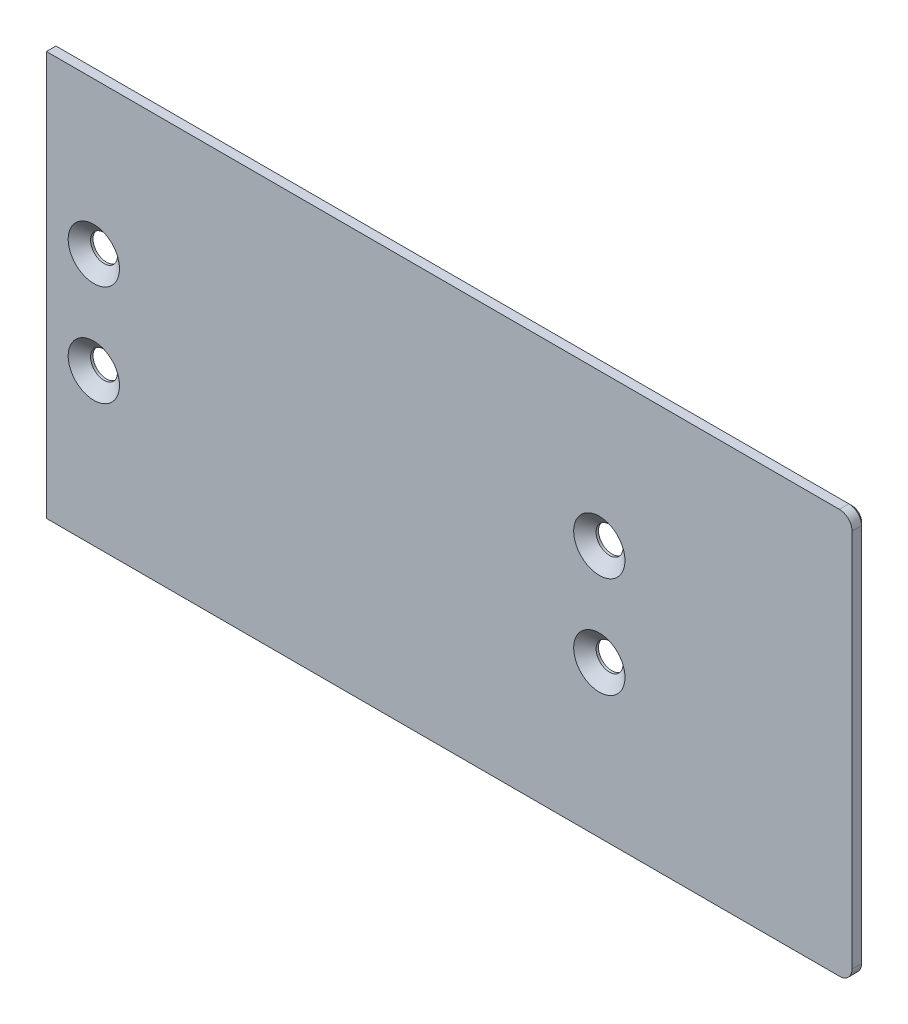
ISO-10303-21;
HEADER;
FILE_DESCRIPTION(('STEP AP214'),'2;1');
FILE_NAME('part.step','',(''),(''),'','','');
FILE_SCHEMA(('AUTOMOTIVE_DESIGN { 1 0 10303 214 1 1 1 1 }'));
ENDSEC;
DATA;
#1=APPLICATION_CONTEXT('core data for automotive mechanical design processes');
#2=APPLICATION_PROTOCOL_DEFINITION('international standard','automotive_design',2000,#1);
#3=PRODUCT_CONTEXT('',#1,'mechanical');
#4=PRODUCT('Part','Part','',(#3));
#5=PRODUCT_RELATED_PRODUCT_CATEGORY('part','',(#4));
#6=PRODUCT_DEFINITION_FORMATION('','',#4);
#7=PRODUCT_DEFINITION_CONTEXT('part definition',#1,'design');
#8=PRODUCT_DEFINITION('design','',#6,#7);
#9=PRODUCT_DEFINITION_SHAPE('','',#8);
#10=(LENGTH_UNIT() NAMED_UNIT(*) SI_UNIT(.MILLI.,.METRE.));
#11=(NAMED_UNIT(*) PLANE_ANGLE_UNIT() SI_UNIT($,.RADIAN.));
#12=(NAMED_UNIT(*) SI_UNIT($,.STERADIAN.) SOLID_ANGLE_UNIT());
#13=UNCERTAINTY_MEASURE_WITH_UNIT(LENGTH_MEASURE(1.E-05),#10,'distance_accuracy_value','');
#14=(GEOMETRIC_REPRESENTATION_CONTEXT(3) GLOBAL_UNCERTAINTY_ASSIGNED_CONTEXT((#13)) GLOBAL_UNIT_ASSIGNED_CONTEXT((#10,
#11,#12)) REPRESENTATION_CONTEXT('',''));
#15=CARTESIAN_POINT('',(0.,0.,0.));
#16=DIRECTION('',(0.,0.,1.));
#17=DIRECTION('',(1.,0.,0.));
#18=AXIS2_PLACEMENT_3D('',#15,#16,#17);
#19=CARTESIAN_POINT('',(202.40625,-101.6,0.));
#20=DIRECTION('',(1.,0.,0.));
#21=DIRECTION('',(0.,0.,-1.));
#22=AXIS2_PLACEMENT_3D('',#19,#20,#21);
#23=PLANE('',#22);
#24=DIRECTION('',(0.,0.,1.));
#25=VECTOR('',#24,1.);
#26=CARTESIAN_POINT('',(202.40625,-98.425,0.));
#27=LINE('',#26,#25);
#28=CARTESIAN_POINT('',(202.40625,-98.425,0.787400000000022));
#29=VERTEX_POINT('',#28);
#30=CARTESIAN_POINT('',(202.40625,-98.425,3.175));
#31=VERTEX_POINT('',#30);
#32=EDGE_CURVE('E128',#29,#31,#27,.T.);
#33=ORIENTED_EDGE('',*,*,#32,.F.);
#34=DIRECTION('',(0.,1.,0.));
#35=VECTOR('',#34,1.);
#36=CARTESIAN_POINT('',(202.40625,-101.6,0.787399999999994));
#37=LINE('',#36,#35);
#38=CARTESIAN_POINT('',(202.40625,-3.175,0.787400000000022));
#39=VERTEX_POINT('',#38);
#40=EDGE_CURVE('E142',#29,#39,#37,.T.);
#41=ORIENTED_EDGE('',*,*,#40,.T.);
#42=DIRECTION('',(0.,0.,1.));
#43=VECTOR('',#42,1.);
#44=CARTESIAN_POINT('',(202.40625,-3.175,0.));
#45=LINE('',#44,#43);
#46=CARTESIAN_POINT('',(202.40625,-3.175,3.175));
#47=VERTEX_POINT('',#46);
#48=EDGE_CURVE('E117',#39,#47,#45,.T.);
#49=ORIENTED_EDGE('',*,*,#48,.T.);
#50=DIRECTION('',(0.,1.,0.));
#51=VECTOR('',#50,1.);
#52=CARTESIAN_POINT('',(202.40625,-101.6,3.175));
#53=LINE('',#52,#51);
#54=EDGE_CURVE('E127',#31,#47,#53,.T.);
#55=ORIENTED_EDGE('',*,*,#54,.F.);
#56=EDGE_LOOP('',(#33,#41,#49,#55));
#57=FACE_BOUND('',#56,.T.);
#58=ADVANCED_FACE('F36',(#57),#23,.T.);
#59=CARTESIAN_POINT('',(0.,-101.6,0.));
#60=DIRECTION('',(0.,1.,0.));
#61=DIRECTION('',(0.,0.,1.));
#62=AXIS2_PLACEMENT_3D('',#59,#60,#61);
#63=PLANE('',#62);
#64=DIRECTION('',(0.,0.,1.));
#65=VECTOR('',#64,1.);
#66=CARTESIAN_POINT('',(0.,-101.6,0.));
#67=LINE('',#66,#65);
#68=CARTESIAN_POINT('',(0.,-101.6,0.787400000000021));
#69=VERTEX_POINT('',#68);
#70=CARTESIAN_POINT('',(0.,-101.6,3.175));
#71=VERTEX_POINT('',#70);
#72=EDGE_CURVE('E133',#69,#71,#67,.T.);
#73=ORIENTED_EDGE('',*,*,#72,.F.);
#74=DIRECTION('',(1.,0.,0.));
#75=VECTOR('',#74,1.);
#76=CARTESIAN_POINT('',(199.23125,-101.6,0.787400000000021));
#77=LINE('',#76,#75);
#78=CARTESIAN_POINT('',(199.23125,-101.6,0.787400000000021));
#79=VERTEX_POINT('',#78);
#80=EDGE_CURVE('E11',#69,#79,#77,.T.);
#81=ORIENTED_EDGE('',*,*,#80,.T.);
#82=DIRECTION('',(0.,0.,1.));
#83=VECTOR('',#82,1.);
#84=CARTESIAN_POINT('',(199.23125,-101.6,0.));
#85=LINE('',#84,#83);
#86=CARTESIAN_POINT('',(199.23125,-101.6,3.175));
#87=VERTEX_POINT('',#86);
#88=EDGE_CURVE('E186',#79,#87,#85,.T.);
#89=ORIENTED_EDGE('',*,*,#88,.T.);
#90=DIRECTION('',(1.,0.,0.));
#91=VECTOR('',#90,1.);
#92=CARTESIAN_POINT('',(0.,-101.6,3.175));
#93=LINE('',#92,#91);
#94=EDGE_CURVE('E135',#71,#87,#93,.T.);
#95=ORIENTED_EDGE('',*,*,#94,.F.);
#96=EDGE_LOOP('',(#73,#81,#89,#95));
#97=FACE_BOUND('',#96,.T.);
#98=ADVANCED_FACE('F231',(#97),#63,.F.);
#99=CARTESIAN_POINT('',(0.,0.,0.));
#100=DIRECTION('',(0.,1.,0.));
#101=DIRECTION('',(0.,0.,1.));
#102=AXIS2_PLACEMENT_3D('',#99,#100,#101);
#103=PLANE('',#102);
#104=DIRECTION('',(0.,0.,1.));
#105=VECTOR('',#104,1.);
#106=CARTESIAN_POINT('',(199.23125,0.,0.));
#107=LINE('',#106,#105);
#108=CARTESIAN_POINT('',(199.23125,0.,0.787400000000021));
#109=VERTEX_POINT('',#108);
#110=CARTESIAN_POINT('',(199.23125,0.,3.175));
#111=VERTEX_POINT('',#110);
#112=EDGE_CURVE('E108',#109,#111,#107,.T.);
#113=ORIENTED_EDGE('',*,*,#112,.F.);
#114=DIRECTION('',(-1.,0.,0.));
#115=VECTOR('',#114,1.);
#116=CARTESIAN_POINT('',(0.,0.,0.787400000000021));
#117=LINE('',#116,#115);
#118=CARTESIAN_POINT('',(0.,0.,0.787400000000021));
#119=VERTEX_POINT('',#118);
#120=EDGE_CURVE('E61',#109,#119,#117,.T.);
#121=ORIENTED_EDGE('',*,*,#120,.T.);
#122=DIRECTION('',(0.,0.,1.));
#123=VECTOR('',#122,1.);
#124=CARTESIAN_POINT('',(0.,0.,0.));
#125=LINE('',#124,#123);
#126=CARTESIAN_POINT('',(0.,0.,3.175));
#127=VERTEX_POINT('',#126);
#128=EDGE_CURVE('E131',#119,#127,#125,.T.);
#129=ORIENTED_EDGE('',*,*,#128,.T.);
#130=DIRECTION('',(1.,0.,0.));
#131=VECTOR('',#130,1.);
#132=CARTESIAN_POINT('',(0.,0.,3.175));
#133=LINE('',#132,#131);
#134=EDGE_CURVE('E124',#127,#111,#133,.T.);
#135=ORIENTED_EDGE('',*,*,#134,.T.);
#136=EDGE_LOOP('',(#113,#121,#129,#135));
#137=FACE_BOUND('',#136,.T.);
#138=ADVANCED_FACE('F130',(#137),#103,.T.);
#139=CARTESIAN_POINT('',(0.,-101.6,0.));
#140=DIRECTION('',(-1.,0.,0.));
#141=DIRECTION('',(0.,0.,1.));
#142=AXIS2_PLACEMENT_3D('',#139,#140,#141);
#143=PLANE('',#142);
#144=ORIENTED_EDGE('',*,*,#128,.F.);
#145=DIRECTION('',(0.,-1.,0.));
#146=VECTOR('',#145,1.);
#147=CARTESIAN_POINT('',(0.,-101.6,0.787400000000021));
#148=LINE('',#147,#146);
#149=EDGE_CURVE('E46',#119,#69,#148,.T.);
#150=ORIENTED_EDGE('',*,*,#149,.T.);
#151=ORIENTED_EDGE('',*,*,#72,.T.);
#152=DIRECTION('',(0.,1.,0.));
#153=VECTOR('',#152,1.);
#154=CARTESIAN_POINT('',(0.,-101.6,3.175));
#155=LINE('',#154,#153);
#156=EDGE_CURVE('E143',#71,#127,#155,.T.);
#157=ORIENTED_EDGE('',*,*,#156,.T.);
#158=EDGE_LOOP('',(#144,#150,#151,#157));
#159=FACE_BOUND('',#158,.T.);
#160=ADVANCED_FACE('F260',(#159),#143,.T.);
#161=CARTESIAN_POINT('',(0.,-101.6,0.));
#162=DIRECTION('',(0.,0.,-1.));
#163=DIRECTION('',(-1.,0.,0.));
#164=AXIS2_PLACEMENT_3D('',#161,#162,#163);
#165=PLANE('',#164);
#166=CARTESIAN_POINT('',(199.23125,-3.17499999999999,0.));
#167=DIRECTION('',(0.,0.,-1.));
#168=DIRECTION('',(-1.,0.,0.));
#169=AXIS2_PLACEMENT_3D('',#166,#167,#168);
#170=CIRCLE('',#169,2.38759999999996);
#171=CARTESIAN_POINT('',(199.23125,-0.787400000000021,0.));
#172=VERTEX_POINT('',#171);
#173=CARTESIAN_POINT('',(201.61885,-3.175,0.));
#174=VERTEX_POINT('',#173);
#175=EDGE_CURVE('E155',#172,#174,#170,.T.);
#176=ORIENTED_EDGE('',*,*,#175,.T.);
#177=DIRECTION('',(0.,-1.,0.));
#178=VECTOR('',#177,1.);
#179=CARTESIAN_POINT('',(201.61885,-101.6,0.));
#180=LINE('',#179,#178);
#181=CARTESIAN_POINT('',(201.61885,-98.425,0.));
#182=VERTEX_POINT('',#181);
#183=EDGE_CURVE('E157',#174,#182,#180,.T.);
#184=ORIENTED_EDGE('',*,*,#183,.T.);
#185=CARTESIAN_POINT('',(199.23125,-98.425,0.));
#186=DIRECTION('',(0.,0.,-1.));
#187=DIRECTION('',(-1.,0.,0.));
#188=AXIS2_PLACEMENT_3D('',#185,#186,#187);
#189=CIRCLE('',#188,2.38759999999998);
#190=CARTESIAN_POINT('',(199.23125,-100.8126,0.));
#191=VERTEX_POINT('',#190);
#192=EDGE_CURVE('E153',#182,#191,#189,.T.);
#193=ORIENTED_EDGE('',*,*,#192,.T.);
#194=DIRECTION('',(-1.,0.,0.));
#195=VECTOR('',#194,1.);
#196=CARTESIAN_POINT('',(0.,-100.8126,0.));
#197=LINE('',#196,#195);
#198=CARTESIAN_POINT('',(0.787400000000021,-100.8126,0.));
#199=VERTEX_POINT('',#198);
#200=EDGE_CURVE('E147',#191,#199,#197,.T.);
#201=ORIENTED_EDGE('',*,*,#200,.T.);
#202=DIRECTION('',(0.,1.,0.));
#203=VECTOR('',#202,1.);
#204=CARTESIAN_POINT('',(0.787400000000021,-101.6,0.));
#205=LINE('',#204,#203);
#206=CARTESIAN_POINT('',(0.787400000000021,-0.787400000000021,0.));
#207=VERTEX_POINT('',#206);
#208=EDGE_CURVE('E149',#199,#207,#205,.T.);
#209=ORIENTED_EDGE('',*,*,#208,.T.);
#210=DIRECTION('',(1.,0.,0.));
#211=VECTOR('',#210,1.);
#212=CARTESIAN_POINT('',(0.,-0.787400000000021,0.));
#213=LINE('',#212,#211);
#214=EDGE_CURVE('E151',#207,#172,#213,.T.);
#215=ORIENTED_EDGE('',*,*,#214,.T.);
#216=EDGE_LOOP('',(#176,#184,#193,#201,#209,#215));
#217=FACE_BOUND('',#216,.T.);
#218=CARTESIAN_POINT('',(11.90625,-38.1,0.));
#219=DIRECTION('',(0.,0.,1.));
#220=DIRECTION('',(1.,0.,0.));
#221=AXIS2_PLACEMENT_3D('',#218,#219,#220);
#222=CIRCLE('',#221,3.3782);
#223=CARTESIAN_POINT('',(15.28445,-38.1,0.));
#224=VERTEX_POINT('',#223);
#225=EDGE_CURVE('E201',#224,#224,#222,.T.);
#226=ORIENTED_EDGE('',*,*,#225,.T.);
#227=EDGE_LOOP('',(#226));
#228=FACE_BOUND('',#227,.T.);
#229=CARTESIAN_POINT('',(11.90625,-63.5,0.));
#230=DIRECTION('',(0.,0.,1.));
#231=DIRECTION('',(1.,0.,0.));
#232=AXIS2_PLACEMENT_3D('',#229,#230,#231);
#233=CIRCLE('',#232,3.3782);
#234=CARTESIAN_POINT('',(15.28445,-63.5,0.));
#235=VERTEX_POINT('',#234);
#236=EDGE_CURVE('E210',#235,#235,#233,.T.);
#237=ORIENTED_EDGE('',*,*,#236,.T.);
#238=EDGE_LOOP('',(#237));
#239=FACE_BOUND('',#238,.T.);
#240=CARTESIAN_POINT('',(138.90625,-63.5,0.));
#241=DIRECTION('',(0.,0.,1.));
#242=DIRECTION('',(1.,0.,0.));
#243=AXIS2_PLACEMENT_3D('',#240,#241,#242);
#244=CIRCLE('',#243,3.3782);
#245=CARTESIAN_POINT('',(142.28445,-63.5,0.));
#246=VERTEX_POINT('',#245);
#247=EDGE_CURVE('E219',#246,#246,#244,.T.);
#248=ORIENTED_EDGE('',*,*,#247,.T.);
#249=EDGE_LOOP('',(#248));
#250=FACE_BOUND('',#249,.T.);
#251=CARTESIAN_POINT('',(138.90625,-38.1,0.));
#252=DIRECTION('',(0.,0.,1.));
#253=DIRECTION('',(1.,0.,0.));
#254=AXIS2_PLACEMENT_3D('',#251,#252,#253);
#255=CIRCLE('',#254,3.3782);
#256=CARTESIAN_POINT('',(142.28445,-38.1,0.));
#257=VERTEX_POINT('',#256);
#258=EDGE_CURVE('E137',#257,#257,#255,.T.);
#259=ORIENTED_EDGE('',*,*,#258,.T.);
#260=EDGE_LOOP('',(#259));
#261=FACE_BOUND('',#260,.T.);
#262=ADVANCED_FACE('F255',(#217,#228,#239,#250,#261),#165,.T.);
#263=CARTESIAN_POINT('',(0.,-101.6,3.175));
#264=DIRECTION('',(0.,0.,1.));
#265=DIRECTION('',(1.,0.,0.));
#266=AXIS2_PLACEMENT_3D('',#263,#264,#265);
#267=PLANE('',#266);
#268=CARTESIAN_POINT('',(199.23125,-3.17499999999999,3.175));
#269=DIRECTION('',(0.,0.,-1.));
#270=DIRECTION('',(1.,0.,0.));
#271=AXIS2_PLACEMENT_3D('',#268,#269,#270);
#272=CIRCLE('',#271,3.17499999999999);
#273=EDGE_CURVE('E112',#111,#47,#272,.T.);
#274=ORIENTED_EDGE('',*,*,#273,.F.);
#275=ORIENTED_EDGE('',*,*,#134,.F.);
#276=ORIENTED_EDGE('',*,*,#156,.F.);
#277=ORIENTED_EDGE('',*,*,#94,.T.);
#278=CARTESIAN_POINT('',(199.23125,-98.425,3.175));
#279=DIRECTION('',(0.,0.,-1.));
#280=DIRECTION('',(-1.,0.,0.));
#281=AXIS2_PLACEMENT_3D('',#278,#279,#280);
#282=CIRCLE('',#281,3.17499999999999);
#283=EDGE_CURVE('E180',#31,#87,#282,.T.);
#284=ORIENTED_EDGE('',*,*,#283,.F.);
#285=ORIENTED_EDGE('',*,*,#54,.T.);
#286=EDGE_LOOP('',(#274,#275,#276,#277,#284,#285));
#287=FACE_BOUND('',#286,.T.);
#288=CARTESIAN_POINT('',(11.90625,-38.1,3.175));
#289=DIRECTION('',(0.,0.,1.));
#290=DIRECTION('',(1.,0.,0.));
#291=AXIS2_PLACEMENT_3D('',#288,#289,#290);
#292=CIRCLE('',#291,6.4389);
#293=CARTESIAN_POINT('',(18.34515,-38.1,3.175));
#294=VERTEX_POINT('',#293);
#295=EDGE_CURVE('E195',#294,#294,#292,.T.);
#296=ORIENTED_EDGE('',*,*,#295,.F.);
#297=EDGE_LOOP('',(#296));
#298=FACE_BOUND('',#297,.T.);
#299=CARTESIAN_POINT('',(11.90625,-63.5,3.175));
#300=DIRECTION('',(0.,0.,1.));
#301=DIRECTION('',(1.,0.,0.));
#302=AXIS2_PLACEMENT_3D('',#299,#300,#301);
#303=CIRCLE('',#302,6.4389);
#304=CARTESIAN_POINT('',(18.34515,-63.5,3.175));
#305=VERTEX_POINT('',#304);
#306=EDGE_CURVE('E204',#305,#305,#303,.T.);
#307=ORIENTED_EDGE('',*,*,#306,.F.);
#308=EDGE_LOOP('',(#307));
#309=FACE_BOUND('',#308,.T.);
#310=CARTESIAN_POINT('',(138.90625,-63.5,3.175));
#311=DIRECTION('',(0.,0.,1.));
#312=DIRECTION('',(1.,0.,0.));
#313=AXIS2_PLACEMENT_3D('',#310,#311,#312);
#314=CIRCLE('',#313,6.4389);
#315=CARTESIAN_POINT('',(145.34515,-63.5,3.175));
#316=VERTEX_POINT('',#315);
#317=EDGE_CURVE('E213',#316,#316,#314,.T.);
#318=ORIENTED_EDGE('',*,*,#317,.F.);
#319=EDGE_LOOP('',(#318));
#320=FACE_BOUND('',#319,.T.);
#321=CARTESIAN_POINT('',(138.90625,-38.1,3.175));
#322=DIRECTION('',(0.,0.,1.));
#323=DIRECTION('',(1.,0.,0.));
#324=AXIS2_PLACEMENT_3D('',#321,#322,#323);
#325=CIRCLE('',#324,6.4389);
#326=CARTESIAN_POINT('',(145.34515,-38.1,3.175));
#327=VERTEX_POINT('',#326);
#328=EDGE_CURVE('E222',#327,#327,#325,.T.);
#329=ORIENTED_EDGE('',*,*,#328,.F.);
#330=EDGE_LOOP('',(#329));
#331=FACE_BOUND('',#330,.T.);
#332=ADVANCED_FACE('F121',(#287,#298,#309,#320,#331),#267,.T.);
#333=CARTESIAN_POINT('',(138.90625,-38.1,3.175));
#334=DIRECTION('',(0.,0.,1.));
#335=DIRECTION('',(1.,0.,0.));
#336=AXIS2_PLACEMENT_3D('',#333,#334,#335);
#337=CYLINDRICAL_SURFACE('',#336,3.3782);
#338=ORIENTED_EDGE('',*,*,#258,.F.);
#339=EDGE_LOOP('',(#338));
#340=FACE_BOUND('',#339,.T.);
#341=CARTESIAN_POINT('',(138.90625,-38.1,0.6067677588557));
#342=DIRECTION('',(0.,0.,1.));
#343=DIRECTION('',(1.,0.,0.));
#344=AXIS2_PLACEMENT_3D('',#341,#342,#343);
#345=CIRCLE('',#344,3.3782);
#346=CARTESIAN_POINT('',(142.28445,-38.1,0.6067677588557));
#347=VERTEX_POINT('',#346);
#348=EDGE_CURVE('E225',#347,#347,#345,.T.);
#349=ORIENTED_EDGE('',*,*,#348,.T.);
#350=EDGE_LOOP('',(#349));
#351=FACE_BOUND('',#350,.T.);
#352=ADVANCED_FACE('F259',(#340,#351),#337,.F.);
#353=CARTESIAN_POINT('',(138.90625,-38.1,3.175));
#354=DIRECTION('',(0.,0.,1.));
#355=DIRECTION('',(1.,0.,0.));
#356=AXIS2_PLACEMENT_3D('',#353,#354,#355);
#357=CONICAL_SURFACE('',#356,6.4389,0.872664625997165);
#358=ORIENTED_EDGE('',*,*,#348,.F.);
#359=EDGE_LOOP('',(#358));
#360=FACE_BOUND('',#359,.T.);
#361=ORIENTED_EDGE('',*,*,#328,.T.);
#362=EDGE_LOOP('',(#361));
#363=FACE_BOUND('',#362,.T.);
#364=ADVANCED_FACE('F313',(#360,#363),#357,.F.);
#365=CARTESIAN_POINT('',(138.90625,-63.5,3.175));
#366=DIRECTION('',(0.,0.,1.));
#367=DIRECTION('',(1.,0.,0.));
#368=AXIS2_PLACEMENT_3D('',#365,#366,#367);
#369=CYLINDRICAL_SURFACE('',#368,3.3782);
#370=ORIENTED_EDGE('',*,*,#247,.F.);
#371=EDGE_LOOP('',(#370));
#372=FACE_BOUND('',#371,.T.);
#373=CARTESIAN_POINT('',(138.90625,-63.5,0.6067677588557));
#374=DIRECTION('',(0.,0.,1.));
#375=DIRECTION('',(1.,0.,0.));
#376=AXIS2_PLACEMENT_3D('',#373,#374,#375);
#377=CIRCLE('',#376,3.3782);
#378=CARTESIAN_POINT('',(142.28445,-63.5,0.6067677588557));
#379=VERTEX_POINT('',#378);
#380=EDGE_CURVE('E216',#379,#379,#377,.T.);
#381=ORIENTED_EDGE('',*,*,#380,.T.);
#382=EDGE_LOOP('',(#381));
#383=FACE_BOUND('',#382,.T.);
#384=ADVANCED_FACE('F319',(#372,#383),#369,.F.);
#385=CARTESIAN_POINT('',(138.90625,-63.5,3.175));
#386=DIRECTION('',(0.,0.,1.));
#387=DIRECTION('',(1.,0.,0.));
#388=AXIS2_PLACEMENT_3D('',#385,#386,#387);
#389=CONICAL_SURFACE('',#388,6.4389,0.872664625997165);
#390=ORIENTED_EDGE('',*,*,#380,.F.);
#391=EDGE_LOOP('',(#390));
#392=FACE_BOUND('',#391,.T.);
#393=ORIENTED_EDGE('',*,*,#317,.T.);
#394=EDGE_LOOP('',(#393));
#395=FACE_BOUND('',#394,.T.);
#396=ADVANCED_FACE('F326',(#392,#395),#389,.F.);
#397=CARTESIAN_POINT('',(11.90625,-63.5,3.175));
#398=DIRECTION('',(0.,0.,1.));
#399=DIRECTION('',(1.,0.,0.));
#400=AXIS2_PLACEMENT_3D('',#397,#398,#399);
#401=CYLINDRICAL_SURFACE('',#400,3.3782);
#402=ORIENTED_EDGE('',*,*,#236,.F.);
#403=EDGE_LOOP('',(#402));
#404=FACE_BOUND('',#403,.T.);
#405=CARTESIAN_POINT('',(11.90625,-63.5,0.6067677588557));
#406=DIRECTION('',(0.,0.,1.));
#407=DIRECTION('',(1.,0.,0.));
#408=AXIS2_PLACEMENT_3D('',#405,#406,#407);
#409=CIRCLE('',#408,3.3782);
#410=CARTESIAN_POINT('',(15.28445,-63.5,0.6067677588557));
#411=VERTEX_POINT('',#410);
#412=EDGE_CURVE('E207',#411,#411,#409,.T.);
#413=ORIENTED_EDGE('',*,*,#412,.T.);
#414=EDGE_LOOP('',(#413));
#415=FACE_BOUND('',#414,.T.);
#416=ADVANCED_FACE('F372',(#404,#415),#401,.F.);
#417=CARTESIAN_POINT('',(11.90625,-63.5,3.175));
#418=DIRECTION('',(0.,0.,1.));
#419=DIRECTION('',(1.,0.,0.));
#420=AXIS2_PLACEMENT_3D('',#417,#418,#419);
#421=CONICAL_SURFACE('',#420,6.4389,0.872664625997165);
#422=ORIENTED_EDGE('',*,*,#412,.F.);
#423=EDGE_LOOP('',(#422));
#424=FACE_BOUND('',#423,.T.);
#425=ORIENTED_EDGE('',*,*,#306,.T.);
#426=EDGE_LOOP('',(#425));
#427=FACE_BOUND('',#426,.T.);
#428=ADVANCED_FACE('F381',(#424,#427),#421,.F.);
#429=CARTESIAN_POINT('',(11.90625,-38.1,3.175));
#430=DIRECTION('',(0.,0.,1.));
#431=DIRECTION('',(1.,0.,0.));
#432=AXIS2_PLACEMENT_3D('',#429,#430,#431);
#433=CYLINDRICAL_SURFACE('',#432,3.3782);
#434=ORIENTED_EDGE('',*,*,#225,.F.);
#435=EDGE_LOOP('',(#434));
#436=FACE_BOUND('',#435,.T.);
#437=CARTESIAN_POINT('',(11.90625,-38.1,0.6067677588557));
#438=DIRECTION('',(0.,0.,1.));
#439=DIRECTION('',(1.,0.,0.));
#440=AXIS2_PLACEMENT_3D('',#437,#438,#439);
#441=CIRCLE('',#440,3.3782);
#442=CARTESIAN_POINT('',(15.28445,-38.1,0.6067677588557));
#443=VERTEX_POINT('',#442);
#444=EDGE_CURVE('E198',#443,#443,#441,.T.);
#445=ORIENTED_EDGE('',*,*,#444,.T.);
#446=EDGE_LOOP('',(#445));
#447=FACE_BOUND('',#446,.T.);
#448=ADVANCED_FACE('F391',(#436,#447),#433,.F.);
#449=CARTESIAN_POINT('',(11.90625,-38.1,3.175));
#450=DIRECTION('',(0.,0.,1.));
#451=DIRECTION('',(1.,0.,0.));
#452=AXIS2_PLACEMENT_3D('',#449,#450,#451);
#453=CONICAL_SURFACE('',#452,6.4389,0.872664625997165);
#454=ORIENTED_EDGE('',*,*,#444,.F.);
#455=EDGE_LOOP('',(#454));
#456=FACE_BOUND('',#455,.T.);
#457=ORIENTED_EDGE('',*,*,#295,.T.);
#458=EDGE_LOOP('',(#457));
#459=FACE_BOUND('',#458,.T.);
#460=ADVANCED_FACE('F400',(#456,#459),#453,.F.);
#461=CARTESIAN_POINT('',(199.23125,-3.17499999999999,0.));
#462=DIRECTION('',(0.,0.,1.));
#463=DIRECTION('',(1.,0.,0.));
#464=AXIS2_PLACEMENT_3D('',#461,#462,#463);
#465=CYLINDRICAL_SURFACE('',#464,3.17499999999999);
#466=ORIENTED_EDGE('',*,*,#48,.F.);
#467=CARTESIAN_POINT('',(199.23125,-3.17499999999999,0.787400000000022));
#468=DIRECTION('',(0.,0.,-1.));
#469=DIRECTION('',(-1.,0.,0.));
#470=AXIS2_PLACEMENT_3D('',#467,#468,#469);
#471=CIRCLE('',#470,3.17499999999999);
#472=EDGE_CURVE('E115',#39,#109,#471,.F.);
#473=ORIENTED_EDGE('',*,*,#472,.T.);
#474=ORIENTED_EDGE('',*,*,#112,.T.);
#475=ORIENTED_EDGE('',*,*,#273,.T.);
#476=EDGE_LOOP('',(#466,#473,#474,#475));
#477=FACE_BOUND('',#476,.T.);
#478=ADVANCED_FACE('F111',(#477),#465,.T.);
#479=CARTESIAN_POINT('',(199.23125,-98.425,0.));
#480=DIRECTION('',(0.,0.,1.));
#481=DIRECTION('',(1.,0.,0.));
#482=AXIS2_PLACEMENT_3D('',#479,#480,#481);
#483=CYLINDRICAL_SURFACE('',#482,3.17499999999999);
#484=ORIENTED_EDGE('',*,*,#88,.F.);
#485=CARTESIAN_POINT('',(199.23125,-98.425,0.787400000000022));
#486=DIRECTION('',(0.,0.,-1.));
#487=DIRECTION('',(-1.,0.,0.));
#488=AXIS2_PLACEMENT_3D('',#485,#486,#487);
#489=CIRCLE('',#488,3.17499999999999);
#490=EDGE_CURVE('E161',#79,#29,#489,.F.);
#491=ORIENTED_EDGE('',*,*,#490,.T.);
#492=ORIENTED_EDGE('',*,*,#32,.T.);
#493=ORIENTED_EDGE('',*,*,#283,.T.);
#494=EDGE_LOOP('',(#484,#491,#492,#493));
#495=FACE_BOUND('',#494,.T.);
#496=ADVANCED_FACE('F233',(#495),#483,.T.);
#497=CARTESIAN_POINT('',(0.787400000000021,-101.6,0.));
#498=DIRECTION('',(0.707106781186548,0.,0.707106781186548));
#499=DIRECTION('',(0.,1.,0.));
#500=AXIS2_PLACEMENT_3D('',#497,#498,#499);
#501=PLANE('',#500);
#502=DIRECTION('',(0.577350269189626,-0.577350269189626,-0.577350269189626));
#503=VECTOR('',#502,1.);
#504=CARTESIAN_POINT('',(34.3916,-34.3916,-33.6042));
#505=LINE('',#504,#503);
#506=EDGE_CURVE('E174',#207,#119,#505,.F.);
#507=ORIENTED_EDGE('',*,*,#506,.F.);
#508=ORIENTED_EDGE('',*,*,#208,.F.);
#509=DIRECTION('',(-0.577350269189626,-0.577350269189626,0.577350269189626));
#510=VECTOR('',#509,1.);
#511=CARTESIAN_POINT('',(0.524933333333347,-101.075066666667,0.262466666666674));
#512=LINE('',#511,#510);
#513=EDGE_CURVE('E41',#69,#199,#512,.F.);
#514=ORIENTED_EDGE('',*,*,#513,.F.);
#515=ORIENTED_EDGE('',*,*,#149,.F.);
#516=EDGE_LOOP('',(#507,#508,#514,#515));
#517=FACE_BOUND('',#516,.T.);
#518=ADVANCED_FACE('F39',(#517),#501,.F.);
#519=CARTESIAN_POINT('',(0.,-100.8126,0.));
#520=DIRECTION('',(0.,-0.707106781186548,-0.707106781186548));
#521=DIRECTION('',(1.,0.,0.));
#522=AXIS2_PLACEMENT_3D('',#519,#520,#521);
#523=PLANE('',#522);
#524=ORIENTED_EDGE('',*,*,#513,.T.);
#525=ORIENTED_EDGE('',*,*,#200,.F.);
#526=DIRECTION('',(0.,0.707106781186548,-0.707106781186547));
#527=VECTOR('',#526,1.);
#528=CARTESIAN_POINT('',(199.23125,-101.6,0.787400000000021));
#529=LINE('',#528,#527);
#530=EDGE_CURVE('E172',#79,#191,#529,.T.);
#531=ORIENTED_EDGE('',*,*,#530,.F.);
#532=ORIENTED_EDGE('',*,*,#80,.F.);
#533=EDGE_LOOP('',(#524,#525,#531,#532));
#534=FACE_BOUND('',#533,.T.);
#535=ADVANCED_FACE('F236',(#534),#523,.T.);
#536=CARTESIAN_POINT('',(0.,0.,0.787400000000021));
#537=DIRECTION('',(0.,-0.707106781186548,0.707106781186548));
#538=DIRECTION('',(-1.,0.,0.));
#539=AXIS2_PLACEMENT_3D('',#536,#537,#538);
#540=PLANE('',#539);
#541=ORIENTED_EDGE('',*,*,#506,.T.);
#542=ORIENTED_EDGE('',*,*,#120,.F.);
#543=DIRECTION('',(0.,0.707106781186547,0.707106781186548));
#544=VECTOR('',#543,1.);
#545=CARTESIAN_POINT('',(199.23125,-0.787400000000021,0.));
#546=LINE('',#545,#544);
#547=EDGE_CURVE('E169',#172,#109,#546,.T.);
#548=ORIENTED_EDGE('',*,*,#547,.F.);
#549=ORIENTED_EDGE('',*,*,#214,.F.);
#550=EDGE_LOOP('',(#541,#542,#548,#549));
#551=FACE_BOUND('',#550,.T.);
#552=ADVANCED_FACE('F281',(#551),#540,.F.);
#553=CARTESIAN_POINT('',(199.23125,-98.425,0.));
#554=DIRECTION('',(0.,0.,1.));
#555=DIRECTION('',(1.,0.,0.));
#556=AXIS2_PLACEMENT_3D('',#553,#554,#555);
#557=CONICAL_SURFACE('',#556,2.38759999999998,0.785398163397444);
#558=ORIENTED_EDGE('',*,*,#530,.T.);
#559=ORIENTED_EDGE('',*,*,#192,.F.);
#560=DIRECTION('',(-0.707106781186535,0.,-0.70710678118656));
#561=VECTOR('',#560,1.);
#562=CARTESIAN_POINT('',(202.40625,-98.425,0.787400000000022));
#563=LINE('',#562,#561);
#564=EDGE_CURVE('E167',#29,#182,#563,.T.);
#565=ORIENTED_EDGE('',*,*,#564,.F.);
#566=ORIENTED_EDGE('',*,*,#490,.F.);
#567=EDGE_LOOP('',(#558,#559,#565,#566));
#568=FACE_BOUND('',#567,.T.);
#569=ADVANCED_FACE('F240',(#568),#557,.T.);
#570=CARTESIAN_POINT('',(199.23125,-3.17499999999999,0.));
#571=DIRECTION('',(0.,0.,1.));
#572=DIRECTION('',(1.,0.,0.));
#573=AXIS2_PLACEMENT_3D('',#570,#571,#572);
#574=CONICAL_SURFACE('',#573,2.38759999999996,0.785398163397452);
#575=ORIENTED_EDGE('',*,*,#547,.T.);
#576=ORIENTED_EDGE('',*,*,#472,.F.);
#577=DIRECTION('',(0.707106781186548,0.,0.707106781186548));
#578=VECTOR('',#577,1.);
#579=CARTESIAN_POINT('',(201.61885,-3.175,0.));
#580=LINE('',#579,#578);
#581=EDGE_CURVE('E165',#174,#39,#580,.T.);
#582=ORIENTED_EDGE('',*,*,#581,.F.);
#583=ORIENTED_EDGE('',*,*,#175,.F.);
#584=EDGE_LOOP('',(#575,#576,#582,#583));
#585=FACE_BOUND('',#584,.T.);
#586=ADVANCED_FACE('F269',(#585),#574,.T.);
#587=CARTESIAN_POINT('',(202.40625,-101.6,0.787399999999994));
#588=DIRECTION('',(-0.707106781186547,0.,0.707106781186547));
#589=DIRECTION('',(0.,1.,0.));
#590=AXIS2_PLACEMENT_3D('',#587,#588,#589);
#591=PLANE('',#590);
#592=ORIENTED_EDGE('',*,*,#564,.T.);
#593=ORIENTED_EDGE('',*,*,#183,.F.);
#594=ORIENTED_EDGE('',*,*,#581,.T.);
#595=ORIENTED_EDGE('',*,*,#40,.F.);
#596=EDGE_LOOP('',(#592,#593,#594,#595));
#597=FACE_BOUND('',#596,.T.);
#598=ADVANCED_FACE('F244',(#597),#591,.F.);
#599=CLOSED_SHELL('',(#58,#98,#138,#160,#262,#332,#352,#364,#384,#396,#416,#428,#448,#460,#478,
#496,#518,#535,#552,#569,#586,#598));
#600=MANIFOLD_SOLID_BREP('B2',#599);
#601=ADVANCED_BREP_SHAPE_REPRESENTATION('',(#18,#600),#14);
#602=SHAPE_DEFINITION_REPRESENTATION(#9,#601);
ENDSEC;
END-ISO-10303-21;
